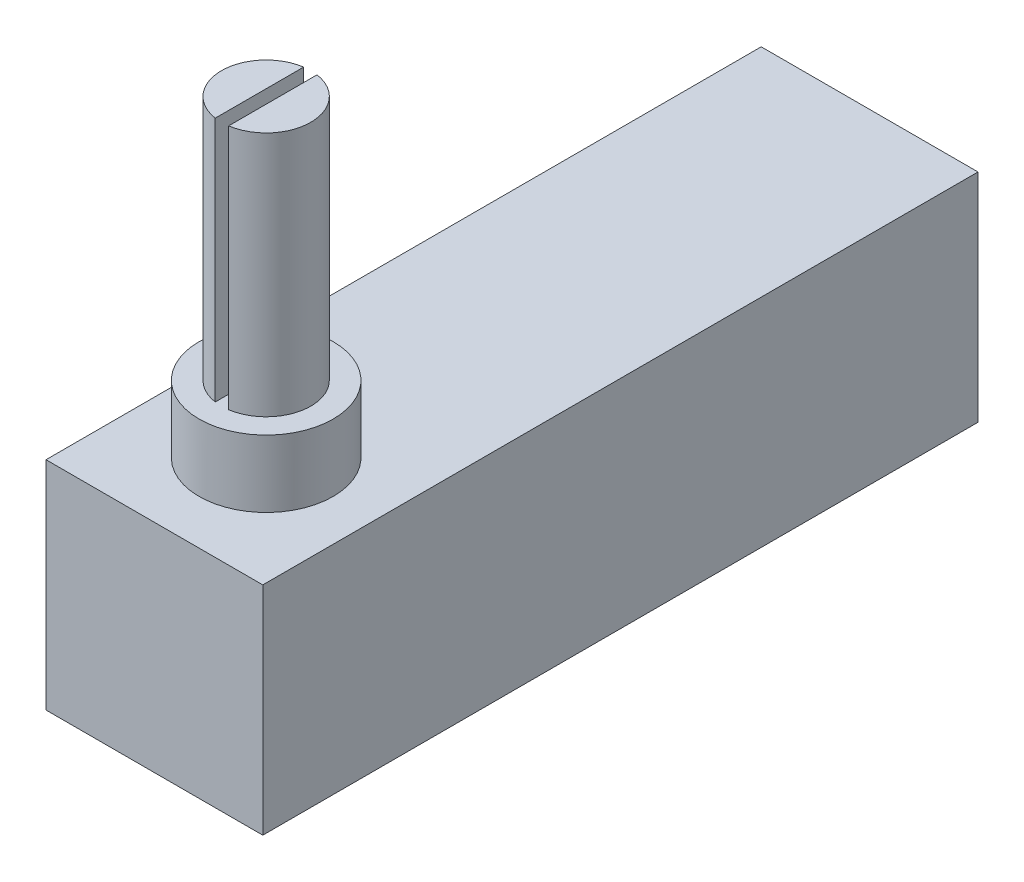
ISO-10303-21;
HEADER;
FILE_DESCRIPTION(('STEP AP214'),'2;1');
FILE_NAME('part.step','',(''),(''),'','','');
FILE_SCHEMA(('AUTOMOTIVE_DESIGN { 1 0 10303 214 1 1 1 1 }'));
ENDSEC;
DATA;
#1=APPLICATION_CONTEXT('core data for automotive mechanical design processes');
#2=APPLICATION_PROTOCOL_DEFINITION('international standard','automotive_design',2000,#1);
#3=PRODUCT_CONTEXT('',#1,'mechanical');
#4=PRODUCT('Part','Part','',(#3));
#5=PRODUCT_RELATED_PRODUCT_CATEGORY('part','',(#4));
#6=PRODUCT_DEFINITION_FORMATION('','',#4);
#7=PRODUCT_DEFINITION_CONTEXT('part definition',#1,'design');
#8=PRODUCT_DEFINITION('design','',#6,#7);
#9=PRODUCT_DEFINITION_SHAPE('','',#8);
#10=(LENGTH_UNIT() NAMED_UNIT(*) SI_UNIT(.MILLI.,.METRE.));
#11=(NAMED_UNIT(*) PLANE_ANGLE_UNIT() SI_UNIT($,.RADIAN.));
#12=(NAMED_UNIT(*) SI_UNIT($,.STERADIAN.) SOLID_ANGLE_UNIT());
#13=UNCERTAINTY_MEASURE_WITH_UNIT(LENGTH_MEASURE(1.E-05),#10,'distance_accuracy_value','');
#14=(GEOMETRIC_REPRESENTATION_CONTEXT(3) GLOBAL_UNCERTAINTY_ASSIGNED_CONTEXT((#13)) GLOBAL_UNIT_ASSIGNED_CONTEXT((#10,
#11,#12)) REPRESENTATION_CONTEXT('',''));
#15=CARTESIAN_POINT('',(0.,0.,0.));
#16=DIRECTION('',(0.,0.,1.));
#17=DIRECTION('',(1.,0.,0.));
#18=AXIS2_PLACEMENT_3D('',#15,#16,#17);
#19=CARTESIAN_POINT('',(-6.1595,0.,40.64));
#20=DIRECTION('',(0.,-1.,0.));
#21=DIRECTION('',(1.,0.,0.));
#22=AXIS2_PLACEMENT_3D('',#19,#20,#21);
#23=PLANE('',#22);
#24=CARTESIAN_POINT('',(0.,0.,34.29));
#25=DIRECTION('',(0.,-1.,0.));
#26=DIRECTION('',(1.,0.,0.));
#27=AXIS2_PLACEMENT_3D('',#24,#25,#26);
#28=CIRCLE('',#27,3.81);
#29=CARTESIAN_POINT('',(3.81,0.,34.29));
#30=VERTEX_POINT('',#29);
#31=EDGE_CURVE('E11',#30,#30,#28,.F.);
#32=ORIENTED_EDGE('',*,*,#31,.F.);
#33=EDGE_LOOP('',(#32));
#34=FACE_BOUND('',#33,.T.);
#35=DIRECTION('',(-1.,0.,0.));
#36=VECTOR('',#35,1.);
#37=CARTESIAN_POINT('',(-6.1595,0.,0.));
#38=LINE('',#37,#36);
#39=CARTESIAN_POINT('',(6.1595,0.,0.));
#40=VERTEX_POINT('',#39);
#41=CARTESIAN_POINT('',(-6.1595,0.,0.));
#42=VERTEX_POINT('',#41);
#43=EDGE_CURVE('E150',#40,#42,#38,.T.);
#44=ORIENTED_EDGE('',*,*,#43,.T.);
#45=DIRECTION('',(0.,0.,-1.));
#46=VECTOR('',#45,1.);
#47=CARTESIAN_POINT('',(-6.1595,0.,40.64));
#48=LINE('',#47,#46);
#49=CARTESIAN_POINT('',(-6.1595,0.,40.64));
#50=VERTEX_POINT('',#49);
#51=EDGE_CURVE('E159',#50,#42,#48,.T.);
#52=ORIENTED_EDGE('',*,*,#51,.F.);
#53=DIRECTION('',(-1.,0.,0.));
#54=VECTOR('',#53,1.);
#55=CARTESIAN_POINT('',(-6.1595,0.,40.64));
#56=LINE('',#55,#54);
#57=CARTESIAN_POINT('',(6.1595,0.,40.64));
#58=VERTEX_POINT('',#57);
#59=EDGE_CURVE('E156',#58,#50,#56,.T.);
#60=ORIENTED_EDGE('',*,*,#59,.F.);
#61=DIRECTION('',(0.,0.,-1.));
#62=VECTOR('',#61,1.);
#63=CARTESIAN_POINT('',(6.1595,0.,40.64));
#64=LINE('',#63,#62);
#65=EDGE_CURVE('E174',#58,#40,#64,.T.);
#66=ORIENTED_EDGE('',*,*,#65,.T.);
#67=EDGE_LOOP('',(#44,#52,#60,#66));
#68=FACE_BOUND('',#67,.T.);
#69=ADVANCED_FACE('F39',(#34,#68),#23,.F.);
#70=CARTESIAN_POINT('',(-6.1595,0.,40.64));
#71=DIRECTION('',(1.,0.,0.));
#72=DIRECTION('',(0.,1.,0.));
#73=AXIS2_PLACEMENT_3D('',#70,#71,#72);
#74=PLANE('',#73);
#75=DIRECTION('',(0.,-1.,0.));
#76=VECTOR('',#75,1.);
#77=CARTESIAN_POINT('',(-6.1595,0.,0.));
#78=LINE('',#77,#76);
#79=CARTESIAN_POINT('',(-6.1595,-12.319,0.));
#80=VERTEX_POINT('',#79);
#81=EDGE_CURVE('E144',#42,#80,#78,.T.);
#82=ORIENTED_EDGE('',*,*,#81,.T.);
#83=DIRECTION('',(0.,0.,-1.));
#84=VECTOR('',#83,1.);
#85=CARTESIAN_POINT('',(-6.1595,-12.319,40.64));
#86=LINE('',#85,#84);
#87=CARTESIAN_POINT('',(-6.1595,-12.319,40.64));
#88=VERTEX_POINT('',#87);
#89=EDGE_CURVE('E109',#88,#80,#86,.T.);
#90=ORIENTED_EDGE('',*,*,#89,.F.);
#91=DIRECTION('',(0.,-1.,0.));
#92=VECTOR('',#91,1.);
#93=CARTESIAN_POINT('',(-6.1595,0.,40.64));
#94=LINE('',#93,#92);
#95=EDGE_CURVE('E145',#50,#88,#94,.T.);
#96=ORIENTED_EDGE('',*,*,#95,.F.);
#97=ORIENTED_EDGE('',*,*,#51,.T.);
#98=EDGE_LOOP('',(#82,#90,#96,#97));
#99=FACE_BOUND('',#98,.T.);
#100=ADVANCED_FACE('F41',(#99),#74,.F.);
#101=CARTESIAN_POINT('',(-6.1595,-12.319,40.64));
#102=DIRECTION('',(0.,1.,0.));
#103=DIRECTION('',(-1.,0.,0.));
#104=AXIS2_PLACEMENT_3D('',#101,#102,#103);
#105=PLANE('',#104);
#106=DIRECTION('',(1.,0.,0.));
#107=VECTOR('',#106,1.);
#108=CARTESIAN_POINT('',(-6.1595,-12.319,0.));
#109=LINE('',#108,#107);
#110=CARTESIAN_POINT('',(6.1595,-12.319,0.));
#111=VERTEX_POINT('',#110);
#112=EDGE_CURVE('E163',#80,#111,#109,.T.);
#113=ORIENTED_EDGE('',*,*,#112,.T.);
#114=DIRECTION('',(0.,0.,-1.));
#115=VECTOR('',#114,1.);
#116=CARTESIAN_POINT('',(6.1595,-12.319,40.64));
#117=LINE('',#116,#115);
#118=CARTESIAN_POINT('',(6.1595,-12.319,40.64));
#119=VERTEX_POINT('',#118);
#120=EDGE_CURVE('E178',#119,#111,#117,.T.);
#121=ORIENTED_EDGE('',*,*,#120,.F.);
#122=DIRECTION('',(1.,0.,0.));
#123=VECTOR('',#122,1.);
#124=CARTESIAN_POINT('',(-6.1595,-12.319,40.64));
#125=LINE('',#124,#123);
#126=EDGE_CURVE('E149',#88,#119,#125,.T.);
#127=ORIENTED_EDGE('',*,*,#126,.F.);
#128=ORIENTED_EDGE('',*,*,#89,.T.);
#129=EDGE_LOOP('',(#113,#121,#127,#128));
#130=FACE_BOUND('',#129,.T.);
#131=ADVANCED_FACE('F186',(#130),#105,.F.);
#132=CARTESIAN_POINT('',(6.1595,0.,40.64));
#133=DIRECTION('',(-1.,0.,0.));
#134=DIRECTION('',(0.,-1.,0.));
#135=AXIS2_PLACEMENT_3D('',#132,#133,#134);
#136=PLANE('',#135);
#137=DIRECTION('',(0.,1.,0.));
#138=VECTOR('',#137,1.);
#139=CARTESIAN_POINT('',(6.1595,0.,0.));
#140=LINE('',#139,#138);
#141=EDGE_CURVE('E166',#111,#40,#140,.T.);
#142=ORIENTED_EDGE('',*,*,#141,.T.);
#143=ORIENTED_EDGE('',*,*,#65,.F.);
#144=DIRECTION('',(0.,1.,0.));
#145=VECTOR('',#144,1.);
#146=CARTESIAN_POINT('',(6.1595,0.,40.64));
#147=LINE('',#146,#145);
#148=EDGE_CURVE('E153',#119,#58,#147,.T.);
#149=ORIENTED_EDGE('',*,*,#148,.F.);
#150=ORIENTED_EDGE('',*,*,#120,.T.);
#151=EDGE_LOOP('',(#142,#143,#149,#150));
#152=FACE_BOUND('',#151,.T.);
#153=ADVANCED_FACE('F198',(#152),#136,.F.);
#154=CARTESIAN_POINT('',(0.,0.,40.64));
#155=DIRECTION('',(0.,0.,1.));
#156=DIRECTION('',(1.,0.,0.));
#157=AXIS2_PLACEMENT_3D('',#154,#155,#156);
#158=PLANE('',#157);
#159=ORIENTED_EDGE('',*,*,#95,.T.);
#160=ORIENTED_EDGE('',*,*,#126,.T.);
#161=ORIENTED_EDGE('',*,*,#148,.T.);
#162=ORIENTED_EDGE('',*,*,#59,.T.);
#163=EDGE_LOOP('',(#159,#160,#161,#162));
#164=FACE_BOUND('',#163,.T.);
#165=ADVANCED_FACE('F203',(#164),#158,.T.);
#166=CARTESIAN_POINT('',(0.,0.,0.));
#167=DIRECTION('',(0.,0.,1.));
#168=DIRECTION('',(1.,0.,0.));
#169=AXIS2_PLACEMENT_3D('',#166,#167,#168);
#170=PLANE('',#169);
#171=ORIENTED_EDGE('',*,*,#81,.F.);
#172=ORIENTED_EDGE('',*,*,#43,.F.);
#173=ORIENTED_EDGE('',*,*,#141,.F.);
#174=ORIENTED_EDGE('',*,*,#112,.F.);
#175=EDGE_LOOP('',(#171,#172,#173,#174));
#176=FACE_BOUND('',#175,.T.);
#177=ADVANCED_FACE('F194',(#176),#170,.F.);
#178=CARTESIAN_POINT('',(0.,3.81,34.29));
#179=DIRECTION('',(0.,1.,0.));
#180=DIRECTION('',(-1.,0.,0.));
#181=AXIS2_PLACEMENT_3D('',#178,#179,#180);
#182=PLANE('',#181);
#183=CARTESIAN_POINT('',(0.,3.81,34.29));
#184=DIRECTION('',(0.,1.,0.));
#185=DIRECTION('',(-1.,0.,0.));
#186=AXIS2_PLACEMENT_3D('',#183,#184,#185);
#187=CIRCLE('',#186,2.54);
#188=CARTESIAN_POINT('',(0.380999999999998,3.81,36.8012624315272));
#189=VERTEX_POINT('',#188);
#190=CARTESIAN_POINT('',(0.380999999999999,3.81,31.7787375684728));
#191=VERTEX_POINT('',#190);
#192=EDGE_CURVE('E61',#189,#191,#187,.T.);
#193=ORIENTED_EDGE('',*,*,#192,.F.);
#194=DIRECTION('',(0.,0.,1.));
#195=VECTOR('',#194,1.);
#196=CARTESIAN_POINT('',(0.380999999999999,3.81,31.7787375684728));
#197=LINE('',#196,#195);
#198=EDGE_CURVE('E48',#191,#189,#197,.T.);
#199=ORIENTED_EDGE('',*,*,#198,.F.);
#200=EDGE_LOOP('',(#193,#199));
#201=FACE_BOUND('',#200,.T.);
#202=CARTESIAN_POINT('',(0.,3.81,34.29));
#203=DIRECTION('',(0.,1.,0.));
#204=DIRECTION('',(-1.,0.,0.));
#205=AXIS2_PLACEMENT_3D('',#202,#203,#204);
#206=CIRCLE('',#205,3.81);
#207=CARTESIAN_POINT('',(-3.81,3.81,34.29));
#208=VERTEX_POINT('',#207);
#209=EDGE_CURVE('E118',#208,#208,#206,.T.);
#210=ORIENTED_EDGE('',*,*,#209,.T.);
#211=EDGE_LOOP('',(#210));
#212=FACE_BOUND('',#211,.T.);
#213=CARTESIAN_POINT('',(0.,3.81,34.29));
#214=DIRECTION('',(0.,1.,0.));
#215=DIRECTION('',(-1.,0.,0.));
#216=AXIS2_PLACEMENT_3D('',#213,#214,#215);
#217=CIRCLE('',#216,2.54);
#218=CARTESIAN_POINT('',(-0.381000000000001,3.81,31.7787375684728));
#219=VERTEX_POINT('',#218);
#220=CARTESIAN_POINT('',(-0.381,3.81,36.8012624315272));
#221=VERTEX_POINT('',#220);
#222=EDGE_CURVE('E54',#219,#221,#217,.T.);
#223=ORIENTED_EDGE('',*,*,#222,.F.);
#224=DIRECTION('',(0.,0.,-1.));
#225=VECTOR('',#224,1.);
#226=CARTESIAN_POINT('',(-0.381000000000001,3.81,31.7787375684728));
#227=LINE('',#226,#225);
#228=EDGE_CURVE('E117',#221,#219,#227,.T.);
#229=ORIENTED_EDGE('',*,*,#228,.F.);
#230=EDGE_LOOP('',(#223,#229));
#231=FACE_BOUND('',#230,.T.);
#232=ADVANCED_FACE('F102',(#201,#212,#231),#182,.T.);
#233=CARTESIAN_POINT('',(0.,3.81,34.29));
#234=DIRECTION('',(0.,-1.,0.));
#235=DIRECTION('',(1.,0.,0.));
#236=AXIS2_PLACEMENT_3D('',#233,#234,#235);
#237=CYLINDRICAL_SURFACE('',#236,3.81);
#238=ORIENTED_EDGE('',*,*,#209,.F.);
#239=EDGE_LOOP('',(#238));
#240=FACE_BOUND('',#239,.T.);
#241=ORIENTED_EDGE('',*,*,#31,.T.);
#242=EDGE_LOOP('',(#241));
#243=FACE_BOUND('',#242,.T.);
#244=ADVANCED_FACE('F252',(#240,#243),#237,.T.);
#245=CARTESIAN_POINT('',(0.,17.78,34.29));
#246=DIRECTION('',(0.,1.,0.));
#247=DIRECTION('',(-1.,0.,0.));
#248=AXIS2_PLACEMENT_3D('',#245,#246,#247);
#249=PLANE('',#248);
#250=CARTESIAN_POINT('',(0.,17.78,34.29));
#251=DIRECTION('',(0.,1.,0.));
#252=DIRECTION('',(-1.,0.,0.));
#253=AXIS2_PLACEMENT_3D('',#250,#251,#252);
#254=CIRCLE('',#253,2.54);
#255=CARTESIAN_POINT('',(-0.381000000000003,17.78,31.7787375684728));
#256=VERTEX_POINT('',#255);
#257=CARTESIAN_POINT('',(-0.381000000000002,17.78,36.8012624315272));
#258=VERTEX_POINT('',#257);
#259=EDGE_CURVE('E124',#256,#258,#254,.T.);
#260=ORIENTED_EDGE('',*,*,#259,.T.);
#261=DIRECTION('',(0.,0.,-1.));
#262=VECTOR('',#261,1.);
#263=CARTESIAN_POINT('',(-0.381000000000003,17.78,31.7787375684728));
#264=LINE('',#263,#262);
#265=EDGE_CURVE('E129',#258,#256,#264,.T.);
#266=ORIENTED_EDGE('',*,*,#265,.T.);
#267=EDGE_LOOP('',(#260,#266));
#268=FACE_BOUND('',#267,.T.);
#269=ADVANCED_FACE('F246',(#268),#249,.T.);
#270=CARTESIAN_POINT('',(-0.381000000000003,17.78,31.7787375684728));
#271=DIRECTION('',(-1.,0.,0.));
#272=DIRECTION('',(0.,-1.,0.));
#273=AXIS2_PLACEMENT_3D('',#270,#271,#272);
#274=PLANE('',#273);
#275=DIRECTION('',(0.,-1.,0.));
#276=VECTOR('',#275,1.);
#277=CARTESIAN_POINT('',(-0.381000000000002,17.78,36.8012624315272));
#278=LINE('',#277,#276);
#279=EDGE_CURVE('E140',#258,#221,#278,.T.);
#280=ORIENTED_EDGE('',*,*,#279,.T.);
#281=ORIENTED_EDGE('',*,*,#228,.T.);
#282=DIRECTION('',(0.,-1.,0.));
#283=VECTOR('',#282,1.);
#284=CARTESIAN_POINT('',(-0.381000000000003,17.78,31.7787375684728));
#285=LINE('',#284,#283);
#286=EDGE_CURVE('E136',#256,#219,#285,.T.);
#287=ORIENTED_EDGE('',*,*,#286,.F.);
#288=ORIENTED_EDGE('',*,*,#265,.F.);
#289=EDGE_LOOP('',(#280,#281,#287,#288));
#290=FACE_BOUND('',#289,.T.);
#291=ADVANCED_FACE('F251',(#290),#274,.F.);
#292=CARTESIAN_POINT('',(0.,17.78,34.29));
#293=DIRECTION('',(0.,-1.,0.));
#294=DIRECTION('',(1.,0.,0.));
#295=AXIS2_PLACEMENT_3D('',#292,#293,#294);
#296=CYLINDRICAL_SURFACE('',#295,2.54);
#297=ORIENTED_EDGE('',*,*,#286,.T.);
#298=ORIENTED_EDGE('',*,*,#222,.T.);
#299=ORIENTED_EDGE('',*,*,#279,.F.);
#300=ORIENTED_EDGE('',*,*,#259,.F.);
#301=EDGE_LOOP('',(#297,#298,#299,#300));
#302=FACE_BOUND('',#301,.T.);
#303=ADVANCED_FACE('F266',(#302),#296,.T.);
#304=CARTESIAN_POINT('',(0.,17.78,34.29));
#305=DIRECTION('',(0.,1.,0.));
#306=DIRECTION('',(-1.,0.,0.));
#307=AXIS2_PLACEMENT_3D('',#304,#305,#306);
#308=PLANE('',#307);
#309=CARTESIAN_POINT('',(0.,17.78,34.29));
#310=DIRECTION('',(0.,1.,0.));
#311=DIRECTION('',(-1.,0.,0.));
#312=AXIS2_PLACEMENT_3D('',#309,#310,#311);
#313=CIRCLE('',#312,2.54);
#314=CARTESIAN_POINT('',(0.380999999999996,17.78,36.8012624315272));
#315=VERTEX_POINT('',#314);
#316=CARTESIAN_POINT('',(0.380999999999997,17.78,31.7787375684728));
#317=VERTEX_POINT('',#316);
#318=EDGE_CURVE('E326',#315,#317,#313,.T.);
#319=ORIENTED_EDGE('',*,*,#318,.T.);
#320=DIRECTION('',(0.,0.,1.));
#321=VECTOR('',#320,1.);
#322=CARTESIAN_POINT('',(0.380999999999997,17.78,31.7787375684728));
#323=LINE('',#322,#321);
#324=EDGE_CURVE('E121',#317,#315,#323,.T.);
#325=ORIENTED_EDGE('',*,*,#324,.T.);
#326=EDGE_LOOP('',(#319,#325));
#327=FACE_BOUND('',#326,.T.);
#328=ADVANCED_FACE('F262',(#327),#308,.T.);
#329=CARTESIAN_POINT('',(0.380999999999997,17.78,31.7787375684728));
#330=DIRECTION('',(1.,0.,0.));
#331=DIRECTION('',(0.,1.,0.));
#332=AXIS2_PLACEMENT_3D('',#329,#330,#331);
#333=PLANE('',#332);
#334=DIRECTION('',(0.,-1.,0.));
#335=VECTOR('',#334,1.);
#336=CARTESIAN_POINT('',(0.380999999999997,17.78,31.7787375684728));
#337=LINE('',#336,#335);
#338=EDGE_CURVE('E114',#317,#191,#337,.T.);
#339=ORIENTED_EDGE('',*,*,#338,.T.);
#340=ORIENTED_EDGE('',*,*,#198,.T.);
#341=DIRECTION('',(0.,-1.,0.));
#342=VECTOR('',#341,1.);
#343=CARTESIAN_POINT('',(0.380999999999996,17.78,36.8012624315272));
#344=LINE('',#343,#342);
#345=EDGE_CURVE('E115',#315,#189,#344,.T.);
#346=ORIENTED_EDGE('',*,*,#345,.F.);
#347=ORIENTED_EDGE('',*,*,#324,.F.);
#348=EDGE_LOOP('',(#339,#340,#346,#347));
#349=FACE_BOUND('',#348,.T.);
#350=ADVANCED_FACE('F120',(#349),#333,.F.);
#351=CARTESIAN_POINT('',(0.,17.78,34.29));
#352=DIRECTION('',(0.,-1.,0.));
#353=DIRECTION('',(1.,0.,0.));
#354=AXIS2_PLACEMENT_3D('',#351,#352,#353);
#355=CYLINDRICAL_SURFACE('',#354,2.54);
#356=ORIENTED_EDGE('',*,*,#345,.T.);
#357=ORIENTED_EDGE('',*,*,#192,.T.);
#358=ORIENTED_EDGE('',*,*,#338,.F.);
#359=ORIENTED_EDGE('',*,*,#318,.F.);
#360=EDGE_LOOP('',(#356,#357,#358,#359));
#361=FACE_BOUND('',#360,.T.);
#362=ADVANCED_FACE('F112',(#361),#355,.T.);
#363=CLOSED_SHELL('',(#69,#100,#131,#153,#165,#177,#232,#244,#269,#291,#303,#328,#350,#362));
#364=MANIFOLD_SOLID_BREP('B2',#363);
#365=ADVANCED_BREP_SHAPE_REPRESENTATION('',(#18,#364),#14);
#366=SHAPE_DEFINITION_REPRESENTATION(#9,#365);
ENDSEC;
END-ISO-10303-21;
